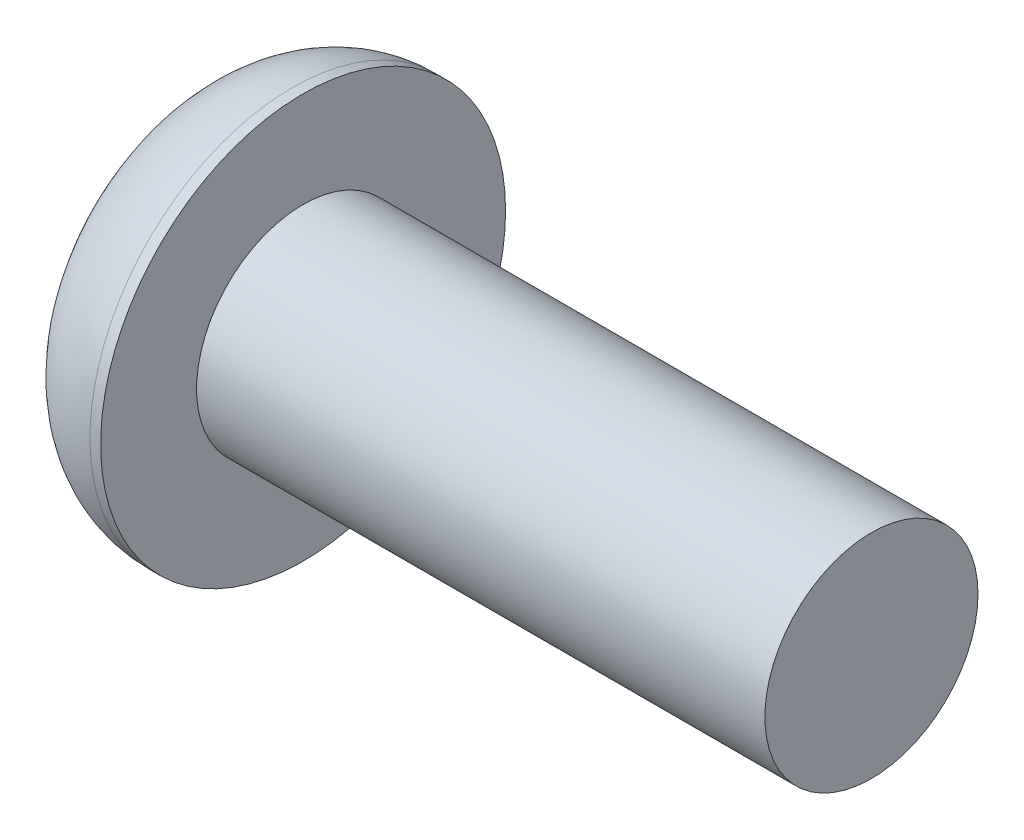
ISO-10303-21;
HEADER;
FILE_DESCRIPTION(('STEP AP214'),'2;1');
FILE_NAME('part.step','',(''),(''),'','','');
FILE_SCHEMA(('AUTOMOTIVE_DESIGN { 1 0 10303 214 1 1 1 1 }'));
ENDSEC;
DATA;
#1=APPLICATION_CONTEXT('core data for automotive mechanical design processes');
#2=APPLICATION_PROTOCOL_DEFINITION('international standard','automotive_design',2000,#1);
#3=PRODUCT_CONTEXT('',#1,'mechanical');
#4=PRODUCT('Part','Part','',(#3));
#5=PRODUCT_RELATED_PRODUCT_CATEGORY('part','',(#4));
#6=PRODUCT_DEFINITION_FORMATION('','',#4);
#7=PRODUCT_DEFINITION_CONTEXT('part definition',#1,'design');
#8=PRODUCT_DEFINITION('design','',#6,#7);
#9=PRODUCT_DEFINITION_SHAPE('','',#8);
#10=(LENGTH_UNIT() NAMED_UNIT(*) SI_UNIT(.MILLI.,.METRE.));
#11=(NAMED_UNIT(*) PLANE_ANGLE_UNIT() SI_UNIT($,.RADIAN.));
#12=(NAMED_UNIT(*) SI_UNIT($,.STERADIAN.) SOLID_ANGLE_UNIT());
#13=UNCERTAINTY_MEASURE_WITH_UNIT(LENGTH_MEASURE(1.E-05),#10,'distance_accuracy_value','');
#14=(GEOMETRIC_REPRESENTATION_CONTEXT(3) GLOBAL_UNCERTAINTY_ASSIGNED_CONTEXT((#13)) GLOBAL_UNIT_ASSIGNED_CONTEXT((#10,
#11,#12)) REPRESENTATION_CONTEXT('',''));
#15=CARTESIAN_POINT('',(0.,0.,0.));
#16=DIRECTION('',(0.,0.,1.));
#17=DIRECTION('',(1.,0.,0.));
#18=AXIS2_PLACEMENT_3D('',#15,#16,#17);
#19=CARTESIAN_POINT('',(0.,0.,-1.34999999999999));
#20=DIRECTION('',(-1.,0.,0.));
#21=DIRECTION('',(0.,0.,1.));
#22=AXIS2_PLACEMENT_3D('',#19,#20,#21);
#23=PLANE('',#22);
#24=DIRECTION('',(0.,0.866025403784439,0.5));
#25=VECTOR('',#24,1.);
#26=CARTESIAN_POINT('',(0.,-1.,0.577350269189626));
#27=LINE('',#26,#25);
#28=CARTESIAN_POINT('',(0.,-1.,0.577350269189626));
#29=VERTEX_POINT('',#28);
#30=CARTESIAN_POINT('',(0.,0.,1.15470053837925));
#31=VERTEX_POINT('',#30);
#32=EDGE_CURVE('E46',#29,#31,#27,.T.);
#33=ORIENTED_EDGE('',*,*,#32,.F.);
#34=DIRECTION('',(0.,0.,1.));
#35=VECTOR('',#34,1.);
#36=CARTESIAN_POINT('',(0.,-1.,-0.577350269189626));
#37=LINE('',#36,#35);
#38=CARTESIAN_POINT('',(0.,-1.,-0.577350269189626));
#39=VERTEX_POINT('',#38);
#40=EDGE_CURVE('E129',#39,#29,#37,.T.);
#41=ORIENTED_EDGE('',*,*,#40,.F.);
#42=DIRECTION('',(0.,-0.866025403784439,0.5));
#43=VECTOR('',#42,1.);
#44=CARTESIAN_POINT('',(0.,0.,-1.15470053837925));
#45=LINE('',#44,#43);
#46=CARTESIAN_POINT('',(0.,0.,-1.15470053837925));
#47=VERTEX_POINT('',#46);
#48=EDGE_CURVE('E127',#47,#39,#45,.T.);
#49=ORIENTED_EDGE('',*,*,#48,.F.);
#50=DIRECTION('',(0.,-0.866025403784439,-0.5));
#51=VECTOR('',#50,1.);
#52=CARTESIAN_POINT('',(0.,1.,-0.577350269189626));
#53=LINE('',#52,#51);
#54=CARTESIAN_POINT('',(0.,1.,-0.577350269189626));
#55=VERTEX_POINT('',#54);
#56=EDGE_CURVE('E94',#55,#47,#53,.T.);
#57=ORIENTED_EDGE('',*,*,#56,.F.);
#58=DIRECTION('',(0.,0.,-1.));
#59=VECTOR('',#58,1.);
#60=CARTESIAN_POINT('',(0.,1.,0.577350269189625));
#61=LINE('',#60,#59);
#62=CARTESIAN_POINT('',(0.,1.,0.577350269189625));
#63=VERTEX_POINT('',#62);
#64=EDGE_CURVE('E123',#63,#55,#61,.T.);
#65=ORIENTED_EDGE('',*,*,#64,.F.);
#66=DIRECTION('',(0.,0.866025403784439,-0.5));
#67=VECTOR('',#66,1.);
#68=CARTESIAN_POINT('',(0.,0.,1.15470053837925));
#69=LINE('',#68,#67);
#70=EDGE_CURVE('E120',#31,#63,#69,.T.);
#71=ORIENTED_EDGE('',*,*,#70,.F.);
#72=EDGE_LOOP('',(#33,#41,#49,#57,#65,#71));
#73=FACE_BOUND('',#72,.T.);
#74=CARTESIAN_POINT('',(0.,0.,0.));
#75=DIRECTION('',(1.,0.,0.));
#76=DIRECTION('',(0.,0.,-1.));
#77=AXIS2_PLACEMENT_3D('',#74,#75,#76);
#78=CIRCLE('',#77,1.34999999999999);
#79=CARTESIAN_POINT('',(0.,0.,-1.34999999999999));
#80=VERTEX_POINT('',#79);
#81=EDGE_CURVE('E11',#80,#80,#78,.T.);
#82=ORIENTED_EDGE('',*,*,#81,.F.);
#83=EDGE_LOOP('',(#82));
#84=FACE_BOUND('',#83,.T.);
#85=ADVANCED_FACE('F32',(#73,#84),#23,.T.);
#86=CARTESIAN_POINT('',(1.5,0.,0.));
#87=DIRECTION('',(1.,0.,0.));
#88=DIRECTION('',(0.,0.,-1.));
#89=AXIS2_PLACEMENT_3D('',#86,#87,#88);
#90=DEGENERATE_TOROIDAL_SURFACE('',#89,1.35,1.5,.T.);
#91=ORIENTED_EDGE('',*,*,#81,.T.);
#92=EDGE_LOOP('',(#91));
#93=FACE_BOUND('',#92,.T.);
#94=CARTESIAN_POINT('',(1.50000000000001,0.,0.));
#95=DIRECTION('',(1.,0.,0.));
#96=DIRECTION('',(0.,0.,-1.));
#97=AXIS2_PLACEMENT_3D('',#94,#95,#96);
#98=CIRCLE('',#97,2.85);
#99=CARTESIAN_POINT('',(1.50000000000001,0.,-2.85));
#100=VERTEX_POINT('',#99);
#101=EDGE_CURVE('E39',#100,#100,#98,.T.);
#102=ORIENTED_EDGE('',*,*,#101,.F.);
#103=EDGE_LOOP('',(#102));
#104=FACE_BOUND('',#103,.T.);
#105=ADVANCED_FACE('F152',(#93,#104),#90,.T.);
#106=CARTESIAN_POINT('',(0.,0.,0.));
#107=DIRECTION('',(1.,0.,0.));
#108=DIRECTION('',(0.,0.,-1.));
#109=AXIS2_PLACEMENT_3D('',#106,#107,#108);
#110=CYLINDRICAL_SURFACE('',#109,2.85);
#111=ORIENTED_EDGE('',*,*,#101,.T.);
#112=EDGE_LOOP('',(#111));
#113=FACE_BOUND('',#112,.T.);
#114=CARTESIAN_POINT('',(1.65,0.,0.));
#115=DIRECTION('',(1.,0.,0.));
#116=DIRECTION('',(0.,0.,-1.));
#117=AXIS2_PLACEMENT_3D('',#114,#115,#116);
#118=CIRCLE('',#117,2.85);
#119=CARTESIAN_POINT('',(1.65,0.,-2.85));
#120=VERTEX_POINT('',#119);
#121=EDGE_CURVE('E144',#120,#120,#118,.T.);
#122=ORIENTED_EDGE('',*,*,#121,.F.);
#123=EDGE_LOOP('',(#122));
#124=FACE_BOUND('',#123,.T.);
#125=ADVANCED_FACE('F149',(#113,#124),#110,.T.);
#126=CARTESIAN_POINT('',(1.65,0.,-1.5));
#127=DIRECTION('',(1.,0.,0.));
#128=DIRECTION('',(0.,0.,-1.));
#129=AXIS2_PLACEMENT_3D('',#126,#127,#128);
#130=PLANE('',#129);
#131=ORIENTED_EDGE('',*,*,#121,.T.);
#132=EDGE_LOOP('',(#131));
#133=FACE_BOUND('',#132,.T.);
#134=CARTESIAN_POINT('',(1.65,0.,0.));
#135=DIRECTION('',(1.,0.,0.));
#136=DIRECTION('',(0.,0.,-1.));
#137=AXIS2_PLACEMENT_3D('',#134,#135,#136);
#138=CIRCLE('',#137,1.5);
#139=CARTESIAN_POINT('',(1.65,0.,-1.5));
#140=VERTEX_POINT('',#139);
#141=EDGE_CURVE('E141',#140,#140,#138,.T.);
#142=ORIENTED_EDGE('',*,*,#141,.F.);
#143=EDGE_LOOP('',(#142));
#144=FACE_BOUND('',#143,.T.);
#145=ADVANCED_FACE('F159',(#133,#144),#130,.T.);
#146=CARTESIAN_POINT('',(0.,0.,0.));
#147=DIRECTION('',(1.,0.,0.));
#148=DIRECTION('',(0.,0.,-1.));
#149=AXIS2_PLACEMENT_3D('',#146,#147,#148);
#150=CYLINDRICAL_SURFACE('',#149,1.5);
#151=ORIENTED_EDGE('',*,*,#141,.T.);
#152=EDGE_LOOP('',(#151));
#153=FACE_BOUND('',#152,.T.);
#154=CARTESIAN_POINT('',(9.65,0.,0.));
#155=DIRECTION('',(1.,0.,0.));
#156=DIRECTION('',(0.,0.,-1.));
#157=AXIS2_PLACEMENT_3D('',#154,#155,#156);
#158=CIRCLE('',#157,1.5);
#159=CARTESIAN_POINT('',(9.65,0.,-1.5));
#160=VERTEX_POINT('',#159);
#161=EDGE_CURVE('E133',#160,#160,#158,.T.);
#162=ORIENTED_EDGE('',*,*,#161,.F.);
#163=EDGE_LOOP('',(#162));
#164=FACE_BOUND('',#163,.T.);
#165=ADVANCED_FACE('F165',(#153,#164),#150,.T.);
#166=CARTESIAN_POINT('',(9.65,0.,0.));
#167=DIRECTION('',(1.,0.,0.));
#168=DIRECTION('',(0.,0.,-1.));
#169=AXIS2_PLACEMENT_3D('',#166,#167,#168);
#170=PLANE('',#169);
#171=ORIENTED_EDGE('',*,*,#161,.T.);
#172=EDGE_LOOP('',(#171));
#173=FACE_BOUND('',#172,.T.);
#174=ADVANCED_FACE('F169',(#173),#170,.T.);
#175=CARTESIAN_POINT('',(1.04,-1.,0.577350269189626));
#176=DIRECTION('',(0.,-0.5,0.866025403784439));
#177=DIRECTION('',(0.,-0.866025403784439,-0.5));
#178=AXIS2_PLACEMENT_3D('',#175,#176,#177);
#179=PLANE('',#178);
#180=ORIENTED_EDGE('',*,*,#32,.T.);
#181=DIRECTION('',(-1.,0.,0.));
#182=VECTOR('',#181,1.);
#183=CARTESIAN_POINT('',(1.04,0.,1.15470053837925));
#184=LINE('',#183,#182);
#185=CARTESIAN_POINT('',(1.04,0.,1.15470053837925));
#186=VERTEX_POINT('',#185);
#187=EDGE_CURVE('E76',#186,#31,#184,.T.);
#188=ORIENTED_EDGE('',*,*,#187,.F.);
#189=DIRECTION('',(0.,0.866025403784439,0.5));
#190=VECTOR('',#189,1.);
#191=CARTESIAN_POINT('',(1.04,-1.,0.577350269189626));
#192=LINE('',#191,#190);
#193=CARTESIAN_POINT('',(1.04,-1.,0.577350269189626));
#194=VERTEX_POINT('',#193);
#195=EDGE_CURVE('E131',#194,#186,#192,.T.);
#196=ORIENTED_EDGE('',*,*,#195,.F.);
#197=DIRECTION('',(-1.,0.,0.));
#198=VECTOR('',#197,1.);
#199=CARTESIAN_POINT('',(1.04,-1.,0.577350269189626));
#200=LINE('',#199,#198);
#201=EDGE_CURVE('E54',#194,#29,#200,.T.);
#202=ORIENTED_EDGE('',*,*,#201,.T.);
#203=EDGE_LOOP('',(#180,#188,#196,#202));
#204=FACE_BOUND('',#203,.T.);
#205=ADVANCED_FACE('F173',(#204),#179,.F.);
#206=CARTESIAN_POINT('',(1.04,-1.,-0.577350269189626));
#207=DIRECTION('',(0.,-1.,0.));
#208=DIRECTION('',(0.,0.,-1.));
#209=AXIS2_PLACEMENT_3D('',#206,#207,#208);
#210=PLANE('',#209);
#211=ORIENTED_EDGE('',*,*,#40,.T.);
#212=ORIENTED_EDGE('',*,*,#201,.F.);
#213=DIRECTION('',(0.,0.,1.));
#214=VECTOR('',#213,1.);
#215=CARTESIAN_POINT('',(1.04,-1.,-0.577350269189626));
#216=LINE('',#215,#214);
#217=CARTESIAN_POINT('',(1.04,-1.,-0.577350269189626));
#218=VERTEX_POINT('',#217);
#219=EDGE_CURVE('E106',#218,#194,#216,.T.);
#220=ORIENTED_EDGE('',*,*,#219,.F.);
#221=DIRECTION('',(-1.,0.,0.));
#222=VECTOR('',#221,1.);
#223=CARTESIAN_POINT('',(1.04,-1.,-0.577350269189626));
#224=LINE('',#223,#222);
#225=EDGE_CURVE('E98',#218,#39,#224,.T.);
#226=ORIENTED_EDGE('',*,*,#225,.T.);
#227=EDGE_LOOP('',(#211,#212,#220,#226));
#228=FACE_BOUND('',#227,.T.);
#229=ADVANCED_FACE('F177',(#228),#210,.F.);
#230=CARTESIAN_POINT('',(1.04,0.,-1.15470053837925));
#231=DIRECTION('',(0.,-0.5,-0.866025403784439));
#232=DIRECTION('',(0.,0.866025403784439,-0.5));
#233=AXIS2_PLACEMENT_3D('',#230,#231,#232);
#234=PLANE('',#233);
#235=ORIENTED_EDGE('',*,*,#48,.T.);
#236=ORIENTED_EDGE('',*,*,#225,.F.);
#237=DIRECTION('',(0.,-0.866025403784439,0.5));
#238=VECTOR('',#237,1.);
#239=CARTESIAN_POINT('',(1.04,0.,-1.15470053837925));
#240=LINE('',#239,#238);
#241=CARTESIAN_POINT('',(1.04,0.,-1.15470053837925));
#242=VERTEX_POINT('',#241);
#243=EDGE_CURVE('E102',#242,#218,#240,.T.);
#244=ORIENTED_EDGE('',*,*,#243,.F.);
#245=DIRECTION('',(-1.,0.,0.));
#246=VECTOR('',#245,1.);
#247=CARTESIAN_POINT('',(1.04,0.,-1.15470053837925));
#248=LINE('',#247,#246);
#249=EDGE_CURVE('E87',#242,#47,#248,.T.);
#250=ORIENTED_EDGE('',*,*,#249,.T.);
#251=EDGE_LOOP('',(#235,#236,#244,#250));
#252=FACE_BOUND('',#251,.T.);
#253=ADVANCED_FACE('F103',(#252),#234,.F.);
#254=CARTESIAN_POINT('',(1.04,1.,-0.577350269189626));
#255=DIRECTION('',(0.,0.5,-0.866025403784439));
#256=DIRECTION('',(0.,0.866025403784439,0.5));
#257=AXIS2_PLACEMENT_3D('',#254,#255,#256);
#258=PLANE('',#257);
#259=ORIENTED_EDGE('',*,*,#56,.T.);
#260=ORIENTED_EDGE('',*,*,#249,.F.);
#261=DIRECTION('',(0.,-0.866025403784439,-0.5));
#262=VECTOR('',#261,1.);
#263=CARTESIAN_POINT('',(1.04,1.,-0.577350269189626));
#264=LINE('',#263,#262);
#265=CARTESIAN_POINT('',(1.04,1.,-0.577350269189626));
#266=VERTEX_POINT('',#265);
#267=EDGE_CURVE('E91',#266,#242,#264,.T.);
#268=ORIENTED_EDGE('',*,*,#267,.F.);
#269=DIRECTION('',(-1.,0.,0.));
#270=VECTOR('',#269,1.);
#271=CARTESIAN_POINT('',(1.04,1.,-0.577350269189626));
#272=LINE('',#271,#270);
#273=EDGE_CURVE('E99',#266,#55,#272,.T.);
#274=ORIENTED_EDGE('',*,*,#273,.T.);
#275=EDGE_LOOP('',(#259,#260,#268,#274));
#276=FACE_BOUND('',#275,.T.);
#277=ADVANCED_FACE('F89',(#276),#258,.F.);
#278=CARTESIAN_POINT('',(1.04,1.,0.577350269189625));
#279=DIRECTION('',(0.,1.,0.));
#280=DIRECTION('',(0.,0.,1.));
#281=AXIS2_PLACEMENT_3D('',#278,#279,#280);
#282=PLANE('',#281);
#283=ORIENTED_EDGE('',*,*,#64,.T.);
#284=ORIENTED_EDGE('',*,*,#273,.F.);
#285=DIRECTION('',(0.,0.,-1.));
#286=VECTOR('',#285,1.);
#287=CARTESIAN_POINT('',(1.04,1.,0.577350269189625));
#288=LINE('',#287,#286);
#289=CARTESIAN_POINT('',(1.04,1.,0.577350269189625));
#290=VERTEX_POINT('',#289);
#291=EDGE_CURVE('E112',#290,#266,#288,.T.);
#292=ORIENTED_EDGE('',*,*,#291,.F.);
#293=DIRECTION('',(-1.,0.,0.));
#294=VECTOR('',#293,1.);
#295=CARTESIAN_POINT('',(1.04,1.,0.577350269189625));
#296=LINE('',#295,#294);
#297=EDGE_CURVE('E136',#290,#63,#296,.T.);
#298=ORIENTED_EDGE('',*,*,#297,.T.);
#299=EDGE_LOOP('',(#283,#284,#292,#298));
#300=FACE_BOUND('',#299,.T.);
#301=ADVANCED_FACE('F181',(#300),#282,.F.);
#302=CARTESIAN_POINT('',(1.04,0.,1.15470053837925));
#303=DIRECTION('',(0.,0.5,0.866025403784439));
#304=DIRECTION('',(0.,-0.866025403784439,0.5));
#305=AXIS2_PLACEMENT_3D('',#302,#303,#304);
#306=PLANE('',#305);
#307=ORIENTED_EDGE('',*,*,#70,.T.);
#308=ORIENTED_EDGE('',*,*,#297,.F.);
#309=DIRECTION('',(0.,0.866025403784439,-0.5));
#310=VECTOR('',#309,1.);
#311=CARTESIAN_POINT('',(1.04,0.,1.15470053837925));
#312=LINE('',#311,#310);
#313=EDGE_CURVE('E114',#186,#290,#312,.T.);
#314=ORIENTED_EDGE('',*,*,#313,.F.);
#315=ORIENTED_EDGE('',*,*,#187,.T.);
#316=EDGE_LOOP('',(#307,#308,#314,#315));
#317=FACE_BOUND('',#316,.T.);
#318=ADVANCED_FACE('F178',(#317),#306,.F.);
#319=CARTESIAN_POINT('',(1.04,0.,0.));
#320=DIRECTION('',(-1.,0.,0.));
#321=DIRECTION('',(0.,0.,1.));
#322=AXIS2_PLACEMENT_3D('',#319,#320,#321);
#323=PLANE('',#322);
#324=ORIENTED_EDGE('',*,*,#195,.T.);
#325=ORIENTED_EDGE('',*,*,#313,.T.);
#326=ORIENTED_EDGE('',*,*,#291,.T.);
#327=ORIENTED_EDGE('',*,*,#267,.T.);
#328=ORIENTED_EDGE('',*,*,#243,.T.);
#329=ORIENTED_EDGE('',*,*,#219,.T.);
#330=EDGE_LOOP('',(#324,#325,#326,#327,#328,#329));
#331=FACE_BOUND('',#330,.T.);
#332=ADVANCED_FACE('F109',(#331),#323,.T.);
#333=CLOSED_SHELL('',(#85,#105,#125,#145,#165,#174,#205,#229,#253,#277,#301,#318,#332));
#334=MANIFOLD_SOLID_BREP('B2',#333);
#335=ADVANCED_BREP_SHAPE_REPRESENTATION('',(#18,#334),#14);
#336=SHAPE_DEFINITION_REPRESENTATION(#9,#335);
ENDSEC;
END-ISO-10303-21;
